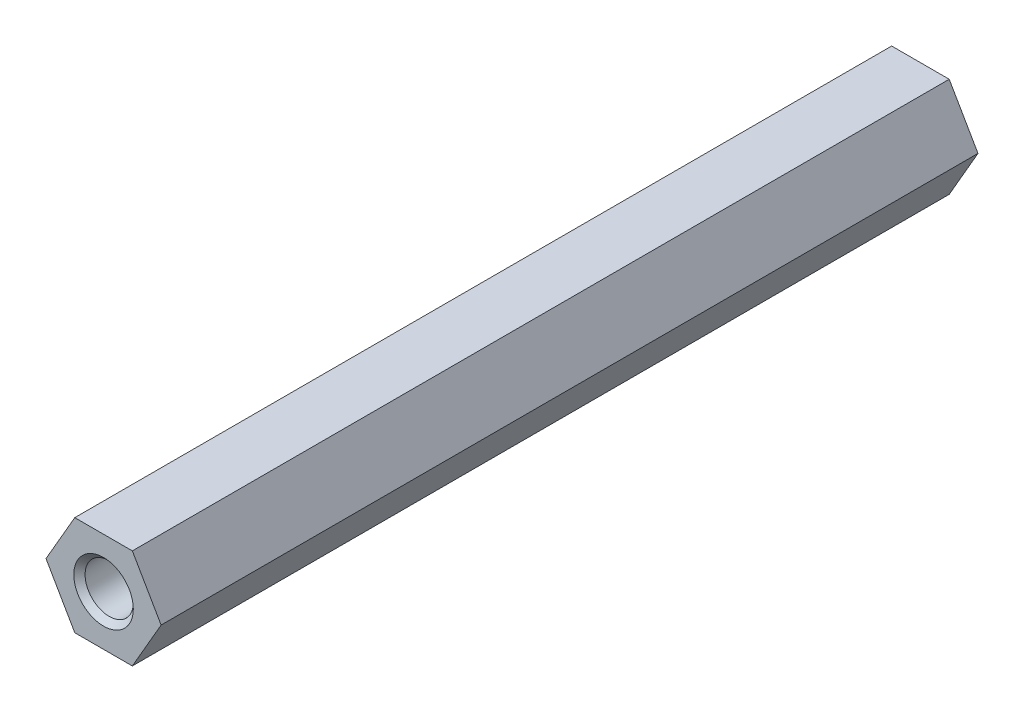
ISO-10303-21;
HEADER;
FILE_DESCRIPTION(('STEP AP214'),'2;1');
FILE_NAME('part.step','',(''),(''),'','','');
FILE_SCHEMA(('AUTOMOTIVE_DESIGN { 1 0 10303 214 1 1 1 1 }'));
ENDSEC;
DATA;
#1=APPLICATION_CONTEXT('core data for automotive mechanical design processes');
#2=APPLICATION_PROTOCOL_DEFINITION('international standard','automotive_design',2000,#1);
#3=PRODUCT_CONTEXT('',#1,'mechanical');
#4=PRODUCT('Part','Part','',(#3));
#5=PRODUCT_RELATED_PRODUCT_CATEGORY('part','',(#4));
#6=PRODUCT_DEFINITION_FORMATION('','',#4);
#7=PRODUCT_DEFINITION_CONTEXT('part definition',#1,'design');
#8=PRODUCT_DEFINITION('design','',#6,#7);
#9=PRODUCT_DEFINITION_SHAPE('','',#8);
#10=(LENGTH_UNIT() NAMED_UNIT(*) SI_UNIT(.MILLI.,.METRE.));
#11=(NAMED_UNIT(*) PLANE_ANGLE_UNIT() SI_UNIT($,.RADIAN.));
#12=(NAMED_UNIT(*) SI_UNIT($,.STERADIAN.) SOLID_ANGLE_UNIT());
#13=UNCERTAINTY_MEASURE_WITH_UNIT(LENGTH_MEASURE(1.E-05),#10,'distance_accuracy_value','');
#14=(GEOMETRIC_REPRESENTATION_CONTEXT(3) GLOBAL_UNCERTAINTY_ASSIGNED_CONTEXT((#13)) GLOBAL_UNIT_ASSIGNED_CONTEXT((#10,
#11,#12)) REPRESENTATION_CONTEXT('',''));
#15=CARTESIAN_POINT('',(0.,0.,0.));
#16=DIRECTION('',(0.,0.,1.));
#17=DIRECTION('',(1.,0.,0.));
#18=AXIS2_PLACEMENT_3D('',#15,#16,#17);
#19=CARTESIAN_POINT('',(-1.78978583448809,3.10000000000005,0.));
#20=DIRECTION('',(-0.866025403784439,0.5,0.));
#21=DIRECTION('',(-0.5,-0.866025403784439,0.));
#22=AXIS2_PLACEMENT_3D('',#19,#20,#21);
#23=PLANE('',#22);
#24=DIRECTION('',(-0.5,-0.866025403784439,0.));
#25=VECTOR('',#24,1.);
#26=CARTESIAN_POINT('',(-1.78978583448809,3.10000000000005,50.8));
#27=LINE('',#26,#25);
#28=CARTESIAN_POINT('',(-1.78978583448809,3.10000000000005,50.8));
#29=VERTEX_POINT('',#28);
#30=CARTESIAN_POINT('',(-3.57957166897597,0.,50.8));
#31=VERTEX_POINT('',#30);
#32=EDGE_CURVE('E121',#29,#31,#27,.T.);
#33=ORIENTED_EDGE('',*,*,#32,.F.);
#34=DIRECTION('',(0.,0.,1.));
#35=VECTOR('',#34,1.);
#36=CARTESIAN_POINT('',(-1.78978583448809,3.10000000000005,0.));
#37=LINE('',#36,#35);
#38=CARTESIAN_POINT('',(-1.78978583448809,3.10000000000005,0.));
#39=VERTEX_POINT('',#38);
#40=EDGE_CURVE('E50',#39,#29,#37,.T.);
#41=ORIENTED_EDGE('',*,*,#40,.F.);
#42=DIRECTION('',(-0.5,-0.866025403784439,0.));
#43=VECTOR('',#42,1.);
#44=CARTESIAN_POINT('',(-1.78978583448809,3.10000000000005,0.));
#45=LINE('',#44,#43);
#46=CARTESIAN_POINT('',(-3.57957166897597,0.,0.));
#47=VERTEX_POINT('',#46);
#48=EDGE_CURVE('E136',#39,#47,#45,.T.);
#49=ORIENTED_EDGE('',*,*,#48,.T.);
#50=DIRECTION('',(0.,0.,1.));
#51=VECTOR('',#50,1.);
#52=CARTESIAN_POINT('',(-3.57957166897597,0.,0.));
#53=LINE('',#52,#51);
#54=EDGE_CURVE('E85',#47,#31,#53,.T.);
#55=ORIENTED_EDGE('',*,*,#54,.T.);
#56=EDGE_LOOP('',(#33,#41,#49,#55));
#57=FACE_BOUND('',#56,.T.);
#58=ADVANCED_FACE('F33',(#57),#23,.T.);
#59=CARTESIAN_POINT('',(1.78978583448794,3.10000000000005,0.));
#60=DIRECTION('',(0.,1.,0.));
#61=DIRECTION('',(-1.,0.,0.));
#62=AXIS2_PLACEMENT_3D('',#59,#60,#61);
#63=PLANE('',#62);
#64=DIRECTION('',(-1.,0.,0.));
#65=VECTOR('',#64,1.);
#66=CARTESIAN_POINT('',(1.78978583448794,3.10000000000005,50.8));
#67=LINE('',#66,#65);
#68=CARTESIAN_POINT('',(1.78978583448794,3.10000000000005,50.8));
#69=VERTEX_POINT('',#68);
#70=EDGE_CURVE('E133',#69,#29,#67,.T.);
#71=ORIENTED_EDGE('',*,*,#70,.F.);
#72=DIRECTION('',(0.,0.,1.));
#73=VECTOR('',#72,1.);
#74=CARTESIAN_POINT('',(1.78978583448794,3.10000000000005,0.));
#75=LINE('',#74,#73);
#76=CARTESIAN_POINT('',(1.78978583448794,3.10000000000005,0.));
#77=VERTEX_POINT('',#76);
#78=EDGE_CURVE('E73',#77,#69,#75,.T.);
#79=ORIENTED_EDGE('',*,*,#78,.F.);
#80=DIRECTION('',(-1.,0.,0.));
#81=VECTOR('',#80,1.);
#82=CARTESIAN_POINT('',(1.78978583448794,3.10000000000005,0.));
#83=LINE('',#82,#81);
#84=EDGE_CURVE('E111',#77,#39,#83,.T.);
#85=ORIENTED_EDGE('',*,*,#84,.T.);
#86=ORIENTED_EDGE('',*,*,#40,.T.);
#87=EDGE_LOOP('',(#71,#79,#85,#86));
#88=FACE_BOUND('',#87,.T.);
#89=ADVANCED_FACE('F173',(#88),#63,.T.);
#90=CARTESIAN_POINT('',(3.57957166897581,0.,0.));
#91=DIRECTION('',(0.866025403784439,0.5,0.));
#92=DIRECTION('',(-0.5,0.866025403784439,0.));
#93=AXIS2_PLACEMENT_3D('',#90,#91,#92);
#94=PLANE('',#93);
#95=DIRECTION('',(-0.5,0.866025403784439,0.));
#96=VECTOR('',#95,1.);
#97=CARTESIAN_POINT('',(3.57957166897581,0.,50.8));
#98=LINE('',#97,#96);
#99=CARTESIAN_POINT('',(3.57957166897581,0.,50.8));
#100=VERTEX_POINT('',#99);
#101=EDGE_CURVE('E98',#100,#69,#98,.T.);
#102=ORIENTED_EDGE('',*,*,#101,.F.);
#103=DIRECTION('',(0.,0.,1.));
#104=VECTOR('',#103,1.);
#105=CARTESIAN_POINT('',(3.57957166897581,0.,0.));
#106=LINE('',#105,#104);
#107=CARTESIAN_POINT('',(3.57957166897581,0.,0.));
#108=VERTEX_POINT('',#107);
#109=EDGE_CURVE('E93',#108,#100,#106,.T.);
#110=ORIENTED_EDGE('',*,*,#109,.F.);
#111=DIRECTION('',(-0.5,0.866025403784439,0.));
#112=VECTOR('',#111,1.);
#113=CARTESIAN_POINT('',(3.57957166897581,0.,0.));
#114=LINE('',#113,#112);
#115=EDGE_CURVE('E96',#108,#77,#114,.T.);
#116=ORIENTED_EDGE('',*,*,#115,.T.);
#117=ORIENTED_EDGE('',*,*,#78,.T.);
#118=EDGE_LOOP('',(#102,#110,#116,#117));
#119=FACE_BOUND('',#118,.T.);
#120=ADVANCED_FACE('F95',(#119),#94,.T.);
#121=CARTESIAN_POINT('',(1.78978583448792,-3.10000000000006,0.));
#122=DIRECTION('',(0.866025403784439,-0.5,0.));
#123=DIRECTION('',(0.5,0.866025403784439,0.));
#124=AXIS2_PLACEMENT_3D('',#121,#122,#123);
#125=PLANE('',#124);
#126=DIRECTION('',(0.5,0.866025403784439,0.));
#127=VECTOR('',#126,1.);
#128=CARTESIAN_POINT('',(1.78978583448792,-3.10000000000006,50.8));
#129=LINE('',#128,#127);
#130=CARTESIAN_POINT('',(1.78978583448792,-3.10000000000006,50.8));
#131=VERTEX_POINT('',#130);
#132=EDGE_CURVE('E130',#131,#100,#129,.T.);
#133=ORIENTED_EDGE('',*,*,#132,.F.);
#134=DIRECTION('',(0.,0.,1.));
#135=VECTOR('',#134,1.);
#136=CARTESIAN_POINT('',(1.78978583448792,-3.10000000000006,0.));
#137=LINE('',#136,#135);
#138=CARTESIAN_POINT('',(1.78978583448792,-3.10000000000006,0.));
#139=VERTEX_POINT('',#138);
#140=EDGE_CURVE('E103',#139,#131,#137,.T.);
#141=ORIENTED_EDGE('',*,*,#140,.F.);
#142=DIRECTION('',(0.5,0.866025403784439,0.));
#143=VECTOR('',#142,1.);
#144=CARTESIAN_POINT('',(1.78978583448792,-3.10000000000006,0.));
#145=LINE('',#144,#143);
#146=EDGE_CURVE('E109',#139,#108,#145,.T.);
#147=ORIENTED_EDGE('',*,*,#146,.T.);
#148=ORIENTED_EDGE('',*,*,#109,.T.);
#149=EDGE_LOOP('',(#133,#141,#147,#148));
#150=FACE_BOUND('',#149,.T.);
#151=ADVANCED_FACE('F113',(#150),#125,.T.);
#152=CARTESIAN_POINT('',(-1.78978583448811,-3.10000000000006,0.));
#153=DIRECTION('',(0.,-1.,0.));
#154=DIRECTION('',(0.,0.,-1.));
#155=AXIS2_PLACEMENT_3D('',#152,#153,#154);
#156=PLANE('',#155);
#157=DIRECTION('',(1.,0.,0.));
#158=VECTOR('',#157,1.);
#159=CARTESIAN_POINT('',(-1.78978583448811,-3.10000000000006,50.8));
#160=LINE('',#159,#158);
#161=CARTESIAN_POINT('',(-1.78978583448811,-3.10000000000006,50.8));
#162=VERTEX_POINT('',#161);
#163=EDGE_CURVE('E127',#162,#131,#160,.T.);
#164=ORIENTED_EDGE('',*,*,#163,.F.);
#165=DIRECTION('',(0.,0.,1.));
#166=VECTOR('',#165,1.);
#167=CARTESIAN_POINT('',(-1.78978583448811,-3.10000000000006,0.));
#168=LINE('',#167,#166);
#169=CARTESIAN_POINT('',(-1.78978583448811,-3.10000000000006,0.));
#170=VERTEX_POINT('',#169);
#171=EDGE_CURVE('E141',#170,#162,#168,.T.);
#172=ORIENTED_EDGE('',*,*,#171,.F.);
#173=DIRECTION('',(1.,0.,0.));
#174=VECTOR('',#173,1.);
#175=CARTESIAN_POINT('',(-1.78978583448811,-3.10000000000006,0.));
#176=LINE('',#175,#174);
#177=EDGE_CURVE('E114',#170,#139,#176,.T.);
#178=ORIENTED_EDGE('',*,*,#177,.T.);
#179=ORIENTED_EDGE('',*,*,#140,.T.);
#180=EDGE_LOOP('',(#164,#172,#178,#179));
#181=FACE_BOUND('',#180,.T.);
#182=ADVANCED_FACE('F169',(#181),#156,.T.);
#183=CARTESIAN_POINT('',(-3.57957166897597,0.,0.));
#184=DIRECTION('',(-0.866025403784439,-0.5,0.));
#185=DIRECTION('',(0.5,-0.866025403784439,0.));
#186=AXIS2_PLACEMENT_3D('',#183,#184,#185);
#187=PLANE('',#186);
#188=DIRECTION('',(0.5,-0.866025403784439,0.));
#189=VECTOR('',#188,1.);
#190=CARTESIAN_POINT('',(-3.57957166897597,0.,50.8));
#191=LINE('',#190,#189);
#192=EDGE_CURVE('E124',#31,#162,#191,.T.);
#193=ORIENTED_EDGE('',*,*,#192,.F.);
#194=ORIENTED_EDGE('',*,*,#54,.F.);
#195=DIRECTION('',(0.5,-0.866025403784439,0.));
#196=VECTOR('',#195,1.);
#197=CARTESIAN_POINT('',(-3.57957166897597,0.,0.));
#198=LINE('',#197,#196);
#199=EDGE_CURVE('E116',#47,#170,#198,.T.);
#200=ORIENTED_EDGE('',*,*,#199,.T.);
#201=ORIENTED_EDGE('',*,*,#171,.T.);
#202=EDGE_LOOP('',(#193,#194,#200,#201));
#203=FACE_BOUND('',#202,.T.);
#204=ADVANCED_FACE('F161',(#203),#187,.T.);
#205=CARTESIAN_POINT('',(0.,0.,0.));
#206=DIRECTION('',(0.,0.,1.));
#207=DIRECTION('',(1.,0.,0.));
#208=AXIS2_PLACEMENT_3D('',#205,#206,#207);
#209=PLANE('',#208);
#210=CARTESIAN_POINT('',(0.,0.,0.));
#211=DIRECTION('',(0.,0.,1.));
#212=DIRECTION('',(1.,0.,0.));
#213=AXIS2_PLACEMENT_3D('',#210,#211,#212);
#214=CIRCLE('',#213,1.85000000007096);
#215=CARTESIAN_POINT('',(1.85000000007096,0.,0.));
#216=VERTEX_POINT('',#215);
#217=EDGE_CURVE('E138',#216,#216,#214,.T.);
#218=ORIENTED_EDGE('',*,*,#217,.T.);
#219=EDGE_LOOP('',(#218));
#220=FACE_BOUND('',#219,.T.);
#221=ORIENTED_EDGE('',*,*,#48,.F.);
#222=ORIENTED_EDGE('',*,*,#84,.F.);
#223=ORIENTED_EDGE('',*,*,#115,.F.);
#224=ORIENTED_EDGE('',*,*,#146,.F.);
#225=ORIENTED_EDGE('',*,*,#177,.F.);
#226=ORIENTED_EDGE('',*,*,#199,.F.);
#227=EDGE_LOOP('',(#221,#222,#223,#224,#225,#226));
#228=FACE_BOUND('',#227,.T.);
#229=ADVANCED_FACE('F107',(#220,#228),#209,.F.);
#230=CARTESIAN_POINT('',(0.,0.,50.8));
#231=DIRECTION('',(0.,0.,1.));
#232=DIRECTION('',(1.,0.,0.));
#233=AXIS2_PLACEMENT_3D('',#230,#231,#232);
#234=PLANE('',#233);
#235=CARTESIAN_POINT('',(0.,0.,50.8));
#236=DIRECTION('',(0.,0.,1.));
#237=DIRECTION('',(1.,0.,0.));
#238=AXIS2_PLACEMENT_3D('',#235,#236,#237);
#239=CIRCLE('',#238,1.85000000001413);
#240=CARTESIAN_POINT('',(1.85000000001413,0.,50.8));
#241=VERTEX_POINT('',#240);
#242=EDGE_CURVE('E11',#241,#241,#239,.F.);
#243=ORIENTED_EDGE('',*,*,#242,.T.);
#244=EDGE_LOOP('',(#243));
#245=FACE_BOUND('',#244,.T.);
#246=ORIENTED_EDGE('',*,*,#32,.T.);
#247=ORIENTED_EDGE('',*,*,#192,.T.);
#248=ORIENTED_EDGE('',*,*,#163,.T.);
#249=ORIENTED_EDGE('',*,*,#132,.T.);
#250=ORIENTED_EDGE('',*,*,#101,.T.);
#251=ORIENTED_EDGE('',*,*,#70,.T.);
#252=EDGE_LOOP('',(#246,#247,#248,#249,#250,#251));
#253=FACE_BOUND('',#252,.T.);
#254=ADVANCED_FACE('F160',(#245,#253),#234,.T.);
#255=CARTESIAN_POINT('',(0.,0.,50.8));
#256=DIRECTION('',(0.,0.,1.));
#257=DIRECTION('',(1.,0.,0.));
#258=AXIS2_PLACEMENT_3D('',#255,#256,#257);
#259=CYLINDRICAL_SURFACE('',#258,1.49999999999998);
#260=CARTESIAN_POINT('',(0.,0.,0.350000000014138));
#261=DIRECTION('',(0.,0.,1.));
#262=DIRECTION('',(1.,0.,0.));
#263=AXIS2_PLACEMENT_3D('',#260,#261,#262);
#264=CIRCLE('',#263,1.49999999999998);
#265=CARTESIAN_POINT('',(1.49999999999998,0.,0.350000000014138));
#266=VERTEX_POINT('',#265);
#267=EDGE_CURVE('E42',#266,#266,#264,.F.);
#268=ORIENTED_EDGE('',*,*,#267,.T.);
#269=EDGE_LOOP('',(#268));
#270=FACE_BOUND('',#269,.T.);
#271=CARTESIAN_POINT('',(0.,0.,50.449999999929));
#272=DIRECTION('',(0.,0.,1.));
#273=DIRECTION('',(1.,0.,0.));
#274=AXIS2_PLACEMENT_3D('',#271,#272,#273);
#275=CIRCLE('',#274,1.49999999999998);
#276=CARTESIAN_POINT('',(1.49999999999998,0.,50.449999999929));
#277=VERTEX_POINT('',#276);
#278=EDGE_CURVE('E146',#277,#277,#275,.T.);
#279=ORIENTED_EDGE('',*,*,#278,.T.);
#280=EDGE_LOOP('',(#279));
#281=FACE_BOUND('',#280,.T.);
#282=ADVANCED_FACE('F151',(#270,#281),#259,.F.);
#283=CARTESIAN_POINT('',(0.,0.,0.));
#284=DIRECTION('',(0.,0.,-1.));
#285=DIRECTION('',(-1.,0.,0.));
#286=AXIS2_PLACEMENT_3D('',#283,#284,#285);
#287=CONICAL_SURFACE('',#286,1.85000000007096,0.785398163478648);
#288=ORIENTED_EDGE('',*,*,#267,.F.);
#289=EDGE_LOOP('',(#288));
#290=FACE_BOUND('',#289,.T.);
#291=ORIENTED_EDGE('',*,*,#217,.F.);
#292=EDGE_LOOP('',(#291));
#293=FACE_BOUND('',#292,.T.);
#294=ADVANCED_FACE('F154',(#290,#293),#287,.F.);
#295=CARTESIAN_POINT('',(0.,0.,50.449999999929));
#296=DIRECTION('',(0.,0.,1.));
#297=DIRECTION('',(1.,0.,0.));
#298=AXIS2_PLACEMENT_3D('',#295,#296,#297);
#299=CONICAL_SURFACE('',#298,1.49999999999998,0.785398163316238);
#300=ORIENTED_EDGE('',*,*,#242,.F.);
#301=EDGE_LOOP('',(#300));
#302=FACE_BOUND('',#301,.T.);
#303=ORIENTED_EDGE('',*,*,#278,.F.);
#304=EDGE_LOOP('',(#303));
#305=FACE_BOUND('',#304,.T.);
#306=ADVANCED_FACE('F35',(#302,#305),#299,.F.);
#307=CLOSED_SHELL('',(#58,#89,#120,#151,#182,#204,#229,#254,#282,#294,#306));
#308=MANIFOLD_SOLID_BREP('B2',#307);
#309=ADVANCED_BREP_SHAPE_REPRESENTATION('',(#18,#308),#14);
#310=SHAPE_DEFINITION_REPRESENTATION(#9,#309);
ENDSEC;
END-ISO-10303-21;
